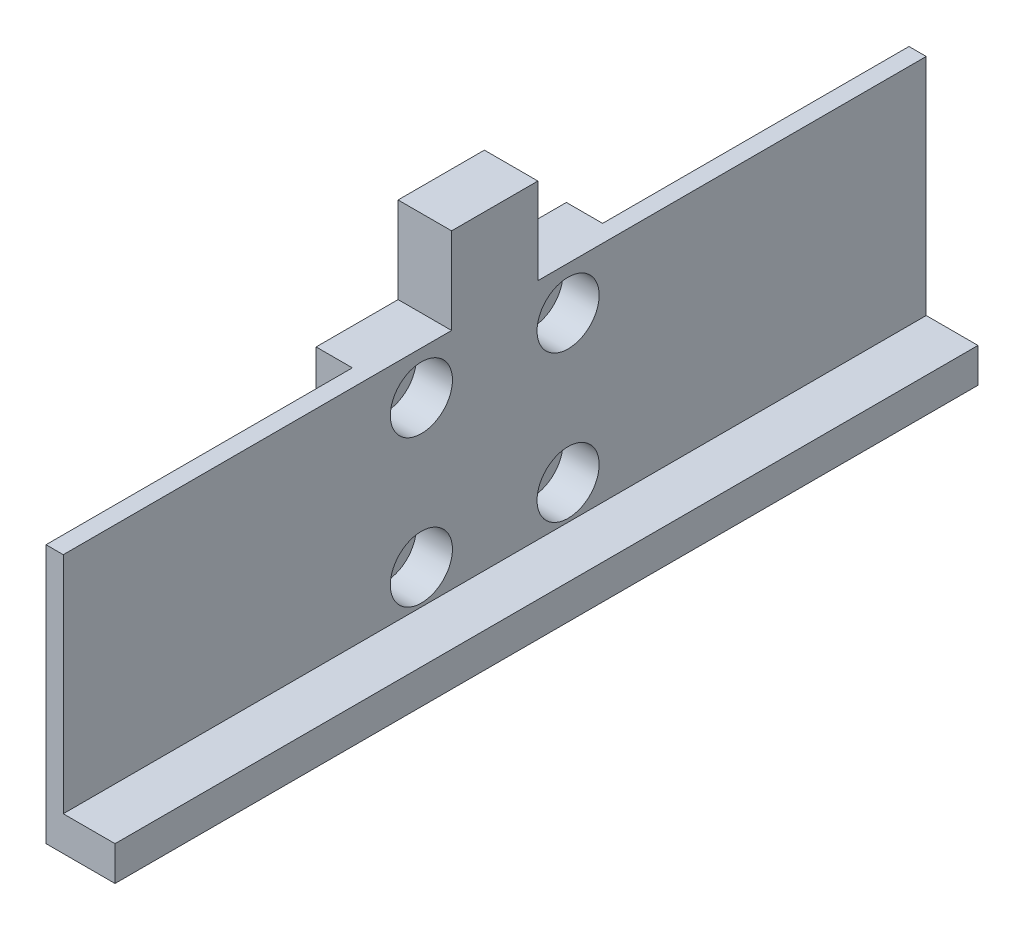
ISO-10303-21;
HEADER;
FILE_DESCRIPTION(('STEP AP214'),'2;1');
FILE_NAME('part.step','',(''),(''),'','','');
FILE_SCHEMA(('AUTOMOTIVE_DESIGN { 1 0 10303 214 1 1 1 1 }'));
ENDSEC;
DATA;
#1=APPLICATION_CONTEXT('core data for automotive mechanical design processes');
#2=APPLICATION_PROTOCOL_DEFINITION('international standard','automotive_design',2000,#1);
#3=PRODUCT_CONTEXT('',#1,'mechanical');
#4=PRODUCT('Part','Part','',(#3));
#5=PRODUCT_RELATED_PRODUCT_CATEGORY('part','',(#4));
#6=PRODUCT_DEFINITION_FORMATION('','',#4);
#7=PRODUCT_DEFINITION_CONTEXT('part definition',#1,'design');
#8=PRODUCT_DEFINITION('design','',#6,#7);
#9=PRODUCT_DEFINITION_SHAPE('','',#8);
#10=(LENGTH_UNIT() NAMED_UNIT(*) SI_UNIT(.MILLI.,.METRE.));
#11=(NAMED_UNIT(*) PLANE_ANGLE_UNIT() SI_UNIT($,.RADIAN.));
#12=(NAMED_UNIT(*) SI_UNIT($,.STERADIAN.) SOLID_ANGLE_UNIT());
#13=UNCERTAINTY_MEASURE_WITH_UNIT(LENGTH_MEASURE(1.E-05),#10,'distance_accuracy_value','');
#14=(GEOMETRIC_REPRESENTATION_CONTEXT(3) GLOBAL_UNCERTAINTY_ASSIGNED_CONTEXT((#13)) GLOBAL_UNIT_ASSIGNED_CONTEXT((#10,
#11,#12)) REPRESENTATION_CONTEXT('',''));
#15=CARTESIAN_POINT('',(0.,0.,0.));
#16=DIRECTION('',(0.,0.,1.));
#17=DIRECTION('',(1.,0.,0.));
#18=AXIS2_PLACEMENT_3D('',#15,#16,#17);
#19=CARTESIAN_POINT('',(6.,26.,-100.));
#20=DIRECTION('',(0.,1.,0.));
#21=DIRECTION('',(0.,0.,1.));
#22=AXIS2_PLACEMENT_3D('',#19,#20,#21);
#23=PLANE('',#22);
#24=DIRECTION('',(0.,0.,-1.));
#25=VECTOR('',#24,1.);
#26=CARTESIAN_POINT('',(14.2,26.,0.));
#27=LINE('',#26,#25);
#28=CARTESIAN_POINT('',(14.2,26.,0.));
#29=VERTEX_POINT('',#28);
#30=CARTESIAN_POINT('',(14.2,26.,-35.5));
#31=VERTEX_POINT('',#30);
#32=EDGE_CURVE('E142',#29,#31,#27,.T.);
#33=ORIENTED_EDGE('',*,*,#32,.F.);
#34=DIRECTION('',(1.,0.,0.));
#35=VECTOR('',#34,1.);
#36=CARTESIAN_POINT('',(6.,26.,0.));
#37=LINE('',#36,#35);
#38=CARTESIAN_POINT('',(16.2,26.,0.));
#39=VERTEX_POINT('',#38);
#40=EDGE_CURVE('E275',#29,#39,#37,.T.);
#41=ORIENTED_EDGE('',*,*,#40,.T.);
#42=DIRECTION('',(0.,0.,1.));
#43=VECTOR('',#42,1.);
#44=CARTESIAN_POINT('',(16.2,26.,-100.));
#45=LINE('',#44,#43);
#46=CARTESIAN_POINT('',(16.2,26.,-45.));
#47=VERTEX_POINT('',#46);
#48=EDGE_CURVE('E264',#47,#39,#45,.T.);
#49=ORIENTED_EDGE('',*,*,#48,.F.);
#50=DIRECTION('',(-1.,0.,0.));
#51=VECTOR('',#50,1.);
#52=CARTESIAN_POINT('',(30.3421356237309,26.,-45.));
#53=LINE('',#52,#51);
#54=CARTESIAN_POINT('',(10.,26.,-45.));
#55=VERTEX_POINT('',#54);
#56=EDGE_CURVE('E183',#47,#55,#53,.T.);
#57=ORIENTED_EDGE('',*,*,#56,.T.);
#58=DIRECTION('',(0.,0.,1.));
#59=VECTOR('',#58,1.);
#60=CARTESIAN_POINT('',(10.,26.,0.));
#61=LINE('',#60,#59);
#62=CARTESIAN_POINT('',(10.,26.,-35.5));
#63=VERTEX_POINT('',#62);
#64=EDGE_CURVE('E278',#55,#63,#61,.T.);
#65=ORIENTED_EDGE('',*,*,#64,.T.);
#66=DIRECTION('',(-1.,0.,0.));
#67=VECTOR('',#66,1.);
#68=CARTESIAN_POINT('',(14.2,26.,-35.5));
#69=LINE('',#68,#67);
#70=EDGE_CURVE('E155',#31,#63,#69,.T.);
#71=ORIENTED_EDGE('',*,*,#70,.F.);
#72=EDGE_LOOP('',(#33,#41,#49,#57,#65,#71));
#73=FACE_BOUND('',#72,.T.);
#74=ADVANCED_FACE('F35',(#73),#23,.T.);
#75=CARTESIAN_POINT('',(12.,0.,0.));
#76=DIRECTION('',(1.,0.,0.));
#77=DIRECTION('',(0.,0.,1.));
#78=AXIS2_PLACEMENT_3D('',#75,#76,#77);
#79=PLANE('',#78);
#80=CARTESIAN_POINT('',(12.,21.,-41.5));
#81=DIRECTION('',(-1.,0.,0.));
#82=DIRECTION('',(0.,0.,1.));
#83=AXIS2_PLACEMENT_3D('',#80,#81,#82);
#84=CIRCLE('',#83,2.1);
#85=CARTESIAN_POINT('',(12.,21.,-39.4));
#86=VERTEX_POINT('',#85);
#87=EDGE_CURVE('E282',#86,#86,#84,.T.);
#88=ORIENTED_EDGE('',*,*,#87,.T.);
#89=EDGE_LOOP('',(#88));
#90=FACE_BOUND('',#89,.T.);
#91=CARTESIAN_POINT('',(12.,21.,-41.5));
#92=DIRECTION('',(1.,0.,0.));
#93=DIRECTION('',(0.,0.,-1.));
#94=AXIS2_PLACEMENT_3D('',#91,#92,#93);
#95=CIRCLE('',#94,3.6);
#96=CARTESIAN_POINT('',(12.,21.,-45.1));
#97=VERTEX_POINT('',#96);
#98=EDGE_CURVE('E258',#97,#97,#95,.T.);
#99=ORIENTED_EDGE('',*,*,#98,.T.);
#100=EDGE_LOOP('',(#99));
#101=FACE_BOUND('',#100,.T.);
#102=ADVANCED_FACE('F310',(#90,#101),#79,.T.);
#103=CARTESIAN_POINT('',(12.,21.,-58.5));
#104=DIRECTION('',(-1.,0.,0.));
#105=DIRECTION('',(0.,0.,1.));
#106=AXIS2_PLACEMENT_3D('',#103,#104,#105);
#107=CIRCLE('',#106,2.1);
#108=CARTESIAN_POINT('',(12.,21.,-56.4));
#109=VERTEX_POINT('',#108);
#110=EDGE_CURVE('E285',#109,#109,#107,.T.);
#111=ORIENTED_EDGE('',*,*,#110,.T.);
#112=EDGE_LOOP('',(#111));
#113=FACE_BOUND('',#112,.T.);
#114=CARTESIAN_POINT('',(12.,21.,-58.5));
#115=DIRECTION('',(1.,0.,0.));
#116=DIRECTION('',(0.,0.,-1.));
#117=AXIS2_PLACEMENT_3D('',#114,#115,#116);
#118=CIRCLE('',#117,3.6);
#119=CARTESIAN_POINT('',(12.,21.,-62.1));
#120=VERTEX_POINT('',#119);
#121=EDGE_CURVE('E252',#120,#120,#118,.T.);
#122=ORIENTED_EDGE('',*,*,#121,.T.);
#123=EDGE_LOOP('',(#122));
#124=FACE_BOUND('',#123,.T.);
#125=ADVANCED_FACE('F319',(#113,#124),#79,.T.);
#126=CARTESIAN_POINT('',(12.,4.,-58.5));
#127=DIRECTION('',(-1.,0.,0.));
#128=DIRECTION('',(0.,0.,1.));
#129=AXIS2_PLACEMENT_3D('',#126,#127,#128);
#130=CIRCLE('',#129,2.1);
#131=CARTESIAN_POINT('',(12.,4.,-56.4));
#132=VERTEX_POINT('',#131);
#133=EDGE_CURVE('E43',#132,#132,#130,.T.);
#134=ORIENTED_EDGE('',*,*,#133,.T.);
#135=EDGE_LOOP('',(#134));
#136=FACE_BOUND('',#135,.T.);
#137=CARTESIAN_POINT('',(12.,4.,-58.5));
#138=DIRECTION('',(1.,0.,0.));
#139=DIRECTION('',(0.,0.,-1.));
#140=AXIS2_PLACEMENT_3D('',#137,#138,#139);
#141=CIRCLE('',#140,3.6);
#142=CARTESIAN_POINT('',(12.,4.,-62.1));
#143=VERTEX_POINT('',#142);
#144=EDGE_CURVE('E246',#143,#143,#141,.T.);
#145=ORIENTED_EDGE('',*,*,#144,.T.);
#146=EDGE_LOOP('',(#145));
#147=FACE_BOUND('',#146,.T.);
#148=ADVANCED_FACE('F290',(#136,#147),#79,.T.);
#149=CARTESIAN_POINT('',(12.,4.,-41.5));
#150=DIRECTION('',(-1.,0.,0.));
#151=DIRECTION('',(0.,0.,1.));
#152=AXIS2_PLACEMENT_3D('',#149,#150,#151);
#153=CIRCLE('',#152,2.1);
#154=CARTESIAN_POINT('',(12.,4.,-39.4));
#155=VERTEX_POINT('',#154);
#156=EDGE_CURVE('E11',#155,#155,#153,.T.);
#157=ORIENTED_EDGE('',*,*,#156,.T.);
#158=EDGE_LOOP('',(#157));
#159=FACE_BOUND('',#158,.T.);
#160=CARTESIAN_POINT('',(12.,4.,-41.5));
#161=DIRECTION('',(1.,0.,0.));
#162=DIRECTION('',(0.,0.,-1.));
#163=AXIS2_PLACEMENT_3D('',#160,#161,#162);
#164=CIRCLE('',#163,3.6);
#165=CARTESIAN_POINT('',(12.,4.,-45.1));
#166=VERTEX_POINT('',#165);
#167=EDGE_CURVE('E241',#166,#166,#164,.T.);
#168=ORIENTED_EDGE('',*,*,#167,.T.);
#169=EDGE_LOOP('',(#168));
#170=FACE_BOUND('',#169,.T.);
#171=ADVANCED_FACE('F322',(#159,#170),#79,.T.);
#172=CARTESIAN_POINT('',(24.,21.,-41.5));
#173=DIRECTION('',(-1.,0.,0.));
#174=DIRECTION('',(0.,0.,-1.));
#175=AXIS2_PLACEMENT_3D('',#172,#173,#174);
#176=CYLINDRICAL_SURFACE('',#175,2.1);
#177=CARTESIAN_POINT('',(10.,21.,-41.5));
#178=DIRECTION('',(1.,0.,0.));
#179=DIRECTION('',(0.,0.,-1.));
#180=AXIS2_PLACEMENT_3D('',#177,#178,#179);
#181=CIRCLE('',#180,2.1);
#182=CARTESIAN_POINT('',(10.,21.,-43.6));
#183=VERTEX_POINT('',#182);
#184=EDGE_CURVE('E215',#183,#183,#181,.F.);
#185=ORIENTED_EDGE('',*,*,#184,.T.);
#186=EDGE_LOOP('',(#185));
#187=FACE_BOUND('',#186,.T.);
#188=ORIENTED_EDGE('',*,*,#87,.F.);
#189=EDGE_LOOP('',(#188));
#190=FACE_BOUND('',#189,.T.);
#191=ADVANCED_FACE('F306',(#187,#190),#176,.F.);
#192=CARTESIAN_POINT('',(24.,21.,-58.5));
#193=DIRECTION('',(-1.,0.,0.));
#194=DIRECTION('',(0.,0.,-1.));
#195=AXIS2_PLACEMENT_3D('',#192,#193,#194);
#196=CYLINDRICAL_SURFACE('',#195,2.1);
#197=CARTESIAN_POINT('',(10.,21.,-58.5));
#198=DIRECTION('',(1.,0.,0.));
#199=DIRECTION('',(0.,0.,-1.));
#200=AXIS2_PLACEMENT_3D('',#197,#198,#199);
#201=CIRCLE('',#200,2.1);
#202=CARTESIAN_POINT('',(10.,21.,-60.6));
#203=VERTEX_POINT('',#202);
#204=EDGE_CURVE('E212',#203,#203,#201,.F.);
#205=ORIENTED_EDGE('',*,*,#204,.T.);
#206=EDGE_LOOP('',(#205));
#207=FACE_BOUND('',#206,.T.);
#208=ORIENTED_EDGE('',*,*,#110,.F.);
#209=EDGE_LOOP('',(#208));
#210=FACE_BOUND('',#209,.T.);
#211=ADVANCED_FACE('F296',(#207,#210),#196,.F.);
#212=CARTESIAN_POINT('',(24.,4.,-58.5));
#213=DIRECTION('',(-1.,0.,0.));
#214=DIRECTION('',(0.,0.,-1.));
#215=AXIS2_PLACEMENT_3D('',#212,#213,#214);
#216=CYLINDRICAL_SURFACE('',#215,2.1);
#217=CARTESIAN_POINT('',(10.,4.,-58.5));
#218=DIRECTION('',(1.,0.,0.));
#219=DIRECTION('',(0.,0.,-1.));
#220=AXIS2_PLACEMENT_3D('',#217,#218,#219);
#221=CIRCLE('',#220,2.1);
#222=CARTESIAN_POINT('',(10.,4.,-60.6));
#223=VERTEX_POINT('',#222);
#224=EDGE_CURVE('E209',#223,#223,#221,.F.);
#225=ORIENTED_EDGE('',*,*,#224,.T.);
#226=EDGE_LOOP('',(#225));
#227=FACE_BOUND('',#226,.T.);
#228=ORIENTED_EDGE('',*,*,#133,.F.);
#229=EDGE_LOOP('',(#228));
#230=FACE_BOUND('',#229,.T.);
#231=ADVANCED_FACE('F293',(#227,#230),#216,.F.);
#232=CARTESIAN_POINT('',(24.,4.,-41.5));
#233=DIRECTION('',(-1.,0.,0.));
#234=DIRECTION('',(0.,0.,-1.));
#235=AXIS2_PLACEMENT_3D('',#232,#233,#234);
#236=CYLINDRICAL_SURFACE('',#235,2.1);
#237=CARTESIAN_POINT('',(10.,4.,-41.5));
#238=DIRECTION('',(1.,0.,0.));
#239=DIRECTION('',(0.,0.,-1.));
#240=AXIS2_PLACEMENT_3D('',#237,#238,#239);
#241=CIRCLE('',#240,2.1);
#242=CARTESIAN_POINT('',(10.,4.,-43.6));
#243=VERTEX_POINT('',#242);
#244=EDGE_CURVE('E206',#243,#243,#241,.F.);
#245=ORIENTED_EDGE('',*,*,#244,.T.);
#246=EDGE_LOOP('',(#245));
#247=FACE_BOUND('',#246,.T.);
#248=ORIENTED_EDGE('',*,*,#156,.F.);
#249=EDGE_LOOP('',(#248));
#250=FACE_BOUND('',#249,.T.);
#251=ADVANCED_FACE('F295',(#247,#250),#236,.F.);
#252=CARTESIAN_POINT('',(10.,0.,-100.));
#253=DIRECTION('',(0.,0.,1.));
#254=DIRECTION('',(-1.,0.,0.));
#255=AXIS2_PLACEMENT_3D('',#252,#253,#254);
#256=PLANE('',#255);
#257=DIRECTION('',(1.,0.,0.));
#258=VECTOR('',#257,1.);
#259=CARTESIAN_POINT('',(-94.0799680255744,-4.,-100.));
#260=LINE('',#259,#258);
#261=CARTESIAN_POINT('',(14.2,-4.,-100.));
#262=VERTEX_POINT('',#261);
#263=CARTESIAN_POINT('',(22.2,-4.,-100.));
#264=VERTEX_POINT('',#263);
#265=EDGE_CURVE('E239',#262,#264,#260,.T.);
#266=ORIENTED_EDGE('',*,*,#265,.F.);
#267=DIRECTION('',(0.,1.,0.));
#268=VECTOR('',#267,1.);
#269=CARTESIAN_POINT('',(14.2,-4.,-100.));
#270=LINE('',#269,#268);
#271=CARTESIAN_POINT('',(14.2,26.,-100.));
#272=VERTEX_POINT('',#271);
#273=EDGE_CURVE('E159',#262,#272,#270,.T.);
#274=ORIENTED_EDGE('',*,*,#273,.T.);
#275=DIRECTION('',(1.,0.,0.));
#276=VECTOR('',#275,1.);
#277=CARTESIAN_POINT('',(6.,26.,-100.));
#278=LINE('',#277,#276);
#279=CARTESIAN_POINT('',(16.2,26.,-100.));
#280=VERTEX_POINT('',#279);
#281=EDGE_CURVE('E276',#272,#280,#278,.T.);
#282=ORIENTED_EDGE('',*,*,#281,.T.);
#283=DIRECTION('',(0.,1.,0.));
#284=VECTOR('',#283,1.);
#285=CARTESIAN_POINT('',(16.2,0.,-100.));
#286=LINE('',#285,#284);
#287=CARTESIAN_POINT('',(16.2,0.,-100.));
#288=VERTEX_POINT('',#287);
#289=EDGE_CURVE('E272',#288,#280,#286,.T.);
#290=ORIENTED_EDGE('',*,*,#289,.F.);
#291=DIRECTION('',(-1.,0.,0.));
#292=VECTOR('',#291,1.);
#293=CARTESIAN_POINT('',(22.2,0.,-100.));
#294=LINE('',#293,#292);
#295=CARTESIAN_POINT('',(22.2,0.,-100.));
#296=VERTEX_POINT('',#295);
#297=EDGE_CURVE('E236',#296,#288,#294,.T.);
#298=ORIENTED_EDGE('',*,*,#297,.F.);
#299=DIRECTION('',(0.,1.,0.));
#300=VECTOR('',#299,1.);
#301=CARTESIAN_POINT('',(22.2,0.,-100.));
#302=LINE('',#301,#300);
#303=EDGE_CURVE('E227',#264,#296,#302,.T.);
#304=ORIENTED_EDGE('',*,*,#303,.F.);
#305=EDGE_LOOP('',(#266,#274,#282,#290,#298,#304));
#306=FACE_BOUND('',#305,.T.);
#307=ADVANCED_FACE('F303',(#306),#256,.F.);
#308=CARTESIAN_POINT('',(10.,0.,0.));
#309=DIRECTION('',(0.,0.,-1.));
#310=DIRECTION('',(1.,0.,0.));
#311=AXIS2_PLACEMENT_3D('',#308,#309,#310);
#312=PLANE('',#311);
#313=ORIENTED_EDGE('',*,*,#40,.F.);
#314=DIRECTION('',(0.,1.,0.));
#315=VECTOR('',#314,1.);
#316=CARTESIAN_POINT('',(14.2,-4.,0.));
#317=LINE('',#316,#315);
#318=CARTESIAN_POINT('',(14.2,-4.,0.));
#319=VERTEX_POINT('',#318);
#320=EDGE_CURVE('E161',#319,#29,#317,.T.);
#321=ORIENTED_EDGE('',*,*,#320,.F.);
#322=DIRECTION('',(1.,0.,0.));
#323=VECTOR('',#322,1.);
#324=CARTESIAN_POINT('',(-94.0799680255744,-4.,0.));
#325=LINE('',#324,#323);
#326=CARTESIAN_POINT('',(22.2,-4.,0.));
#327=VERTEX_POINT('',#326);
#328=EDGE_CURVE('E154',#319,#327,#325,.T.);
#329=ORIENTED_EDGE('',*,*,#328,.T.);
#330=DIRECTION('',(0.,-1.,0.));
#331=VECTOR('',#330,1.);
#332=CARTESIAN_POINT('',(22.2,0.,0.));
#333=LINE('',#332,#331);
#334=CARTESIAN_POINT('',(22.2,0.,0.));
#335=VERTEX_POINT('',#334);
#336=EDGE_CURVE('E221',#335,#327,#333,.T.);
#337=ORIENTED_EDGE('',*,*,#336,.F.);
#338=DIRECTION('',(-1.,0.,0.));
#339=VECTOR('',#338,1.);
#340=CARTESIAN_POINT('',(22.2,0.,0.));
#341=LINE('',#340,#339);
#342=CARTESIAN_POINT('',(16.2,0.,0.));
#343=VERTEX_POINT('',#342);
#344=EDGE_CURVE('E231',#335,#343,#341,.T.);
#345=ORIENTED_EDGE('',*,*,#344,.T.);
#346=DIRECTION('',(0.,-1.,0.));
#347=VECTOR('',#346,1.);
#348=CARTESIAN_POINT('',(16.2,26.,0.));
#349=LINE('',#348,#347);
#350=EDGE_CURVE('E270',#39,#343,#349,.T.);
#351=ORIENTED_EDGE('',*,*,#350,.F.);
#352=EDGE_LOOP('',(#313,#321,#329,#337,#345,#351));
#353=FACE_BOUND('',#352,.T.);
#354=ADVANCED_FACE('F37',(#353),#312,.F.);
#355=CARTESIAN_POINT('',(10.,0.,0.));
#356=DIRECTION('',(1.,0.,0.));
#357=DIRECTION('',(0.,0.,1.));
#358=AXIS2_PLACEMENT_3D('',#355,#356,#357);
#359=PLANE('',#358);
#360=DIRECTION('',(0.,0.,-1.));
#361=VECTOR('',#360,1.);
#362=CARTESIAN_POINT('',(10.,-4.,0.));
#363=LINE('',#362,#361);
#364=CARTESIAN_POINT('',(10.,-4.,-35.5));
#365=VERTEX_POINT('',#364);
#366=CARTESIAN_POINT('',(10.,-4.,-64.5));
#367=VERTEX_POINT('',#366);
#368=EDGE_CURVE('E218',#365,#367,#363,.T.);
#369=ORIENTED_EDGE('',*,*,#368,.F.);
#370=DIRECTION('',(0.,1.,0.));
#371=VECTOR('',#370,1.);
#372=CARTESIAN_POINT('',(10.,-4.,-35.5));
#373=LINE('',#372,#371);
#374=EDGE_CURVE('E58',#365,#63,#373,.T.);
#375=ORIENTED_EDGE('',*,*,#374,.T.);
#376=ORIENTED_EDGE('',*,*,#64,.F.);
#377=DIRECTION('',(0.,1.,0.));
#378=VECTOR('',#377,1.);
#379=CARTESIAN_POINT('',(10.,26.,-45.));
#380=LINE('',#379,#378);
#381=CARTESIAN_POINT('',(10.,36.,-45.));
#382=VERTEX_POINT('',#381);
#383=EDGE_CURVE('E184',#55,#382,#380,.T.);
#384=ORIENTED_EDGE('',*,*,#383,.T.);
#385=DIRECTION('',(0.,0.,-1.));
#386=VECTOR('',#385,1.);
#387=CARTESIAN_POINT('',(10.,36.,-55.));
#388=LINE('',#387,#386);
#389=CARTESIAN_POINT('',(10.,36.,-55.));
#390=VERTEX_POINT('',#389);
#391=EDGE_CURVE('E180',#382,#390,#388,.T.);
#392=ORIENTED_EDGE('',*,*,#391,.T.);
#393=DIRECTION('',(0.,-1.,0.));
#394=VECTOR('',#393,1.);
#395=CARTESIAN_POINT('',(10.,26.,-55.));
#396=LINE('',#395,#394);
#397=CARTESIAN_POINT('',(10.,26.,-55.));
#398=VERTEX_POINT('',#397);
#399=EDGE_CURVE('E163',#390,#398,#396,.T.);
#400=ORIENTED_EDGE('',*,*,#399,.T.);
#401=CARTESIAN_POINT('',(10.,26.,-64.5));
#402=VERTEX_POINT('',#401);
#403=EDGE_CURVE('E280',#402,#398,#61,.T.);
#404=ORIENTED_EDGE('',*,*,#403,.F.);
#405=DIRECTION('',(0.,1.,0.));
#406=VECTOR('',#405,1.);
#407=CARTESIAN_POINT('',(10.,-4.,-64.5));
#408=LINE('',#407,#406);
#409=EDGE_CURVE('E170',#367,#402,#408,.T.);
#410=ORIENTED_EDGE('',*,*,#409,.F.);
#411=EDGE_LOOP('',(#369,#375,#376,#384,#392,#400,#404,#410));
#412=FACE_BOUND('',#411,.T.);
#413=ORIENTED_EDGE('',*,*,#204,.F.);
#414=EDGE_LOOP('',(#413));
#415=FACE_BOUND('',#414,.T.);
#416=ORIENTED_EDGE('',*,*,#244,.F.);
#417=EDGE_LOOP('',(#416));
#418=FACE_BOUND('',#417,.T.);
#419=ORIENTED_EDGE('',*,*,#224,.F.);
#420=EDGE_LOOP('',(#419));
#421=FACE_BOUND('',#420,.T.);
#422=ORIENTED_EDGE('',*,*,#184,.F.);
#423=EDGE_LOOP('',(#422));
#424=FACE_BOUND('',#423,.T.);
#425=ADVANCED_FACE('F326',(#412,#415,#418,#421,#424),#359,.F.);
#426=DIRECTION('',(0.,0.,-1.));
#427=VECTOR('',#426,1.);
#428=CARTESIAN_POINT('',(14.2,26.,-100.));
#429=LINE('',#428,#427);
#430=CARTESIAN_POINT('',(14.2,26.,-64.5));
#431=VERTEX_POINT('',#430);
#432=EDGE_CURVE('E168',#431,#272,#429,.T.);
#433=ORIENTED_EDGE('',*,*,#432,.F.);
#434=DIRECTION('',(1.,0.,0.));
#435=VECTOR('',#434,1.);
#436=CARTESIAN_POINT('',(10.,26.,-64.5));
#437=LINE('',#436,#435);
#438=EDGE_CURVE('E171',#402,#431,#437,.T.);
#439=ORIENTED_EDGE('',*,*,#438,.F.);
#440=ORIENTED_EDGE('',*,*,#403,.T.);
#441=DIRECTION('',(-1.,0.,0.));
#442=VECTOR('',#441,1.);
#443=CARTESIAN_POINT('',(30.3421356237309,26.,-55.));
#444=LINE('',#443,#442);
#445=CARTESIAN_POINT('',(16.2,26.,-55.));
#446=VERTEX_POINT('',#445);
#447=EDGE_CURVE('E191',#446,#398,#444,.T.);
#448=ORIENTED_EDGE('',*,*,#447,.F.);
#449=EDGE_CURVE('E267',#280,#446,#45,.T.);
#450=ORIENTED_EDGE('',*,*,#449,.F.);
#451=ORIENTED_EDGE('',*,*,#281,.F.);
#452=EDGE_LOOP('',(#433,#439,#440,#448,#450,#451));
#453=FACE_BOUND('',#452,.T.);
#454=ADVANCED_FACE('F313',(#453),#23,.T.);
#455=CARTESIAN_POINT('',(16.2,0.,0.));
#456=DIRECTION('',(1.,0.,0.));
#457=DIRECTION('',(0.,0.,-1.));
#458=AXIS2_PLACEMENT_3D('',#455,#456,#457);
#459=PLANE('',#458);
#460=DIRECTION('',(0.,0.,1.));
#461=VECTOR('',#460,1.);
#462=CARTESIAN_POINT('',(16.2,0.,0.));
#463=LINE('',#462,#461);
#464=EDGE_CURVE('E220',#288,#343,#463,.T.);
#465=ORIENTED_EDGE('',*,*,#464,.F.);
#466=ORIENTED_EDGE('',*,*,#289,.T.);
#467=ORIENTED_EDGE('',*,*,#449,.T.);
#468=DIRECTION('',(0.,-1.,0.));
#469=VECTOR('',#468,1.);
#470=CARTESIAN_POINT('',(16.2,26.,-55.));
#471=LINE('',#470,#469);
#472=CARTESIAN_POINT('',(16.2,36.,-55.));
#473=VERTEX_POINT('',#472);
#474=EDGE_CURVE('E189',#473,#446,#471,.T.);
#475=ORIENTED_EDGE('',*,*,#474,.F.);
#476=DIRECTION('',(0.,0.,-1.));
#477=VECTOR('',#476,1.);
#478=CARTESIAN_POINT('',(16.2,36.,-55.));
#479=LINE('',#478,#477);
#480=CARTESIAN_POINT('',(16.2,36.,-45.));
#481=VERTEX_POINT('',#480);
#482=EDGE_CURVE('E193',#481,#473,#479,.T.);
#483=ORIENTED_EDGE('',*,*,#482,.F.);
#484=DIRECTION('',(0.,1.,0.));
#485=VECTOR('',#484,1.);
#486=CARTESIAN_POINT('',(16.2,26.,-45.));
#487=LINE('',#486,#485);
#488=EDGE_CURVE('E197',#47,#481,#487,.T.);
#489=ORIENTED_EDGE('',*,*,#488,.F.);
#490=ORIENTED_EDGE('',*,*,#48,.T.);
#491=ORIENTED_EDGE('',*,*,#350,.T.);
#492=EDGE_LOOP('',(#465,#466,#467,#475,#483,#489,#490,#491));
#493=FACE_BOUND('',#492,.T.);
#494=CARTESIAN_POINT('',(16.2,4.,-58.5));
#495=DIRECTION('',(1.,0.,0.));
#496=DIRECTION('',(0.,0.,-1.));
#497=AXIS2_PLACEMENT_3D('',#494,#495,#496);
#498=CIRCLE('',#497,3.6);
#499=CARTESIAN_POINT('',(16.2,4.,-62.1));
#500=VERTEX_POINT('',#499);
#501=EDGE_CURVE('E249',#500,#500,#498,.T.);
#502=ORIENTED_EDGE('',*,*,#501,.F.);
#503=EDGE_LOOP('',(#502));
#504=FACE_BOUND('',#503,.T.);
#505=CARTESIAN_POINT('',(16.2,21.,-41.5));
#506=DIRECTION('',(1.,0.,0.));
#507=DIRECTION('',(0.,0.,-1.));
#508=AXIS2_PLACEMENT_3D('',#505,#506,#507);
#509=CIRCLE('',#508,3.6);
#510=CARTESIAN_POINT('',(16.2,21.,-45.1));
#511=VERTEX_POINT('',#510);
#512=EDGE_CURVE('E261',#511,#511,#509,.T.);
#513=ORIENTED_EDGE('',*,*,#512,.F.);
#514=EDGE_LOOP('',(#513));
#515=FACE_BOUND('',#514,.T.);
#516=CARTESIAN_POINT('',(16.2,21.,-58.5));
#517=DIRECTION('',(1.,0.,0.));
#518=DIRECTION('',(0.,0.,-1.));
#519=AXIS2_PLACEMENT_3D('',#516,#517,#518);
#520=CIRCLE('',#519,3.6);
#521=CARTESIAN_POINT('',(16.2,21.,-62.1));
#522=VERTEX_POINT('',#521);
#523=EDGE_CURVE('E255',#522,#522,#520,.T.);
#524=ORIENTED_EDGE('',*,*,#523,.F.);
#525=EDGE_LOOP('',(#524));
#526=FACE_BOUND('',#525,.T.);
#527=CARTESIAN_POINT('',(16.2,4.,-41.5));
#528=DIRECTION('',(1.,0.,0.));
#529=DIRECTION('',(0.,0.,-1.));
#530=AXIS2_PLACEMENT_3D('',#527,#528,#529);
#531=CIRCLE('',#530,3.6);
#532=CARTESIAN_POINT('',(16.2,4.,-45.1));
#533=VERTEX_POINT('',#532);
#534=EDGE_CURVE('E243',#533,#533,#531,.T.);
#535=ORIENTED_EDGE('',*,*,#534,.F.);
#536=EDGE_LOOP('',(#535));
#537=FACE_BOUND('',#536,.T.);
#538=ADVANCED_FACE('F325',(#493,#504,#515,#526,#537),#459,.T.);
#539=CARTESIAN_POINT('',(16.2,21.,-41.5));
#540=DIRECTION('',(-1.,0.,0.));
#541=DIRECTION('',(0.,0.,1.));
#542=AXIS2_PLACEMENT_3D('',#539,#540,#541);
#543=CYLINDRICAL_SURFACE('',#542,3.6);
#544=ORIENTED_EDGE('',*,*,#512,.T.);
#545=EDGE_LOOP('',(#544));
#546=FACE_BOUND('',#545,.T.);
#547=ORIENTED_EDGE('',*,*,#98,.F.);
#548=EDGE_LOOP('',(#547));
#549=FACE_BOUND('',#548,.T.);
#550=ADVANCED_FACE('F333',(#546,#549),#543,.F.);
#551=CARTESIAN_POINT('',(16.2,21.,-58.5));
#552=DIRECTION('',(-1.,0.,0.));
#553=DIRECTION('',(0.,0.,1.));
#554=AXIS2_PLACEMENT_3D('',#551,#552,#553);
#555=CYLINDRICAL_SURFACE('',#554,3.6);
#556=ORIENTED_EDGE('',*,*,#523,.T.);
#557=EDGE_LOOP('',(#556));
#558=FACE_BOUND('',#557,.T.);
#559=ORIENTED_EDGE('',*,*,#121,.F.);
#560=EDGE_LOOP('',(#559));
#561=FACE_BOUND('',#560,.T.);
#562=ADVANCED_FACE('F399',(#558,#561),#555,.F.);
#563=CARTESIAN_POINT('',(16.2,4.,-58.5));
#564=DIRECTION('',(-1.,0.,0.));
#565=DIRECTION('',(0.,0.,1.));
#566=AXIS2_PLACEMENT_3D('',#563,#564,#565);
#567=CYLINDRICAL_SURFACE('',#566,3.6);
#568=ORIENTED_EDGE('',*,*,#501,.T.);
#569=EDGE_LOOP('',(#568));
#570=FACE_BOUND('',#569,.T.);
#571=ORIENTED_EDGE('',*,*,#144,.F.);
#572=EDGE_LOOP('',(#571));
#573=FACE_BOUND('',#572,.T.);
#574=ADVANCED_FACE('F395',(#570,#573),#567,.F.);
#575=CARTESIAN_POINT('',(16.2,4.,-41.5));
#576=DIRECTION('',(-1.,0.,0.));
#577=DIRECTION('',(0.,0.,1.));
#578=AXIS2_PLACEMENT_3D('',#575,#576,#577);
#579=CYLINDRICAL_SURFACE('',#578,3.6);
#580=ORIENTED_EDGE('',*,*,#534,.T.);
#581=EDGE_LOOP('',(#580));
#582=FACE_BOUND('',#581,.T.);
#583=ORIENTED_EDGE('',*,*,#167,.F.);
#584=EDGE_LOOP('',(#583));
#585=FACE_BOUND('',#584,.T.);
#586=ADVANCED_FACE('F392',(#582,#585),#579,.F.);
#587=CARTESIAN_POINT('',(-94.0799680255744,-4.,-100.));
#588=DIRECTION('',(0.,1.,0.));
#589=DIRECTION('',(0.,0.,1.));
#590=AXIS2_PLACEMENT_3D('',#587,#588,#589);
#591=PLANE('',#590);
#592=ORIENTED_EDGE('',*,*,#328,.F.);
#593=DIRECTION('',(0.,0.,-1.));
#594=VECTOR('',#593,1.);
#595=CARTESIAN_POINT('',(14.2,-4.,0.));
#596=LINE('',#595,#594);
#597=CARTESIAN_POINT('',(14.2,-4.,-35.5));
#598=VERTEX_POINT('',#597);
#599=EDGE_CURVE('E139',#319,#598,#596,.T.);
#600=ORIENTED_EDGE('',*,*,#599,.T.);
#601=DIRECTION('',(-1.,0.,0.));
#602=VECTOR('',#601,1.);
#603=CARTESIAN_POINT('',(14.2,-4.,-35.5));
#604=LINE('',#603,#602);
#605=EDGE_CURVE('E144',#598,#365,#604,.T.);
#606=ORIENTED_EDGE('',*,*,#605,.T.);
#607=ORIENTED_EDGE('',*,*,#368,.T.);
#608=DIRECTION('',(1.,0.,0.));
#609=VECTOR('',#608,1.);
#610=CARTESIAN_POINT('',(10.,-4.,-64.5));
#611=LINE('',#610,#609);
#612=CARTESIAN_POINT('',(14.2,-4.,-64.5));
#613=VERTEX_POINT('',#612);
#614=EDGE_CURVE('E165',#367,#613,#611,.T.);
#615=ORIENTED_EDGE('',*,*,#614,.T.);
#616=DIRECTION('',(0.,0.,-1.));
#617=VECTOR('',#616,1.);
#618=CARTESIAN_POINT('',(14.2,-4.,-100.));
#619=LINE('',#618,#617);
#620=EDGE_CURVE('E50',#613,#262,#619,.T.);
#621=ORIENTED_EDGE('',*,*,#620,.T.);
#622=ORIENTED_EDGE('',*,*,#265,.T.);
#623=DIRECTION('',(0.,0.,-1.));
#624=VECTOR('',#623,1.);
#625=CARTESIAN_POINT('',(22.2,-4.,0.));
#626=LINE('',#625,#624);
#627=EDGE_CURVE('E224',#327,#264,#626,.T.);
#628=ORIENTED_EDGE('',*,*,#627,.F.);
#629=EDGE_LOOP('',(#592,#600,#606,#607,#615,#621,#622,#628));
#630=FACE_BOUND('',#629,.T.);
#631=ADVANCED_FACE('F152',(#630),#591,.F.);
#632=CARTESIAN_POINT('',(22.2,0.,0.));
#633=DIRECTION('',(0.,-1.,0.));
#634=DIRECTION('',(0.,0.,-1.));
#635=AXIS2_PLACEMENT_3D('',#632,#633,#634);
#636=PLANE('',#635);
#637=ORIENTED_EDGE('',*,*,#464,.T.);
#638=ORIENTED_EDGE('',*,*,#344,.F.);
#639=DIRECTION('',(0.,0.,1.));
#640=VECTOR('',#639,1.);
#641=CARTESIAN_POINT('',(22.2,0.,0.));
#642=LINE('',#641,#640);
#643=EDGE_CURVE('E229',#296,#335,#642,.T.);
#644=ORIENTED_EDGE('',*,*,#643,.F.);
#645=ORIENTED_EDGE('',*,*,#297,.T.);
#646=EDGE_LOOP('',(#637,#638,#644,#645));
#647=FACE_BOUND('',#646,.T.);
#648=ADVANCED_FACE('F387',(#647),#636,.F.);
#649=CARTESIAN_POINT('',(22.2,0.,0.));
#650=DIRECTION('',(1.,0.,0.));
#651=DIRECTION('',(0.,0.,-1.));
#652=AXIS2_PLACEMENT_3D('',#649,#650,#651);
#653=PLANE('',#652);
#654=ORIENTED_EDGE('',*,*,#336,.T.);
#655=ORIENTED_EDGE('',*,*,#627,.T.);
#656=ORIENTED_EDGE('',*,*,#303,.T.);
#657=ORIENTED_EDGE('',*,*,#643,.T.);
#658=EDGE_LOOP('',(#654,#655,#656,#657));
#659=FACE_BOUND('',#658,.T.);
#660=ADVANCED_FACE('F349',(#659),#653,.T.);
#661=CARTESIAN_POINT('',(30.3421356237309,26.,-45.));
#662=DIRECTION('',(0.,0.,1.));
#663=DIRECTION('',(0.,-1.,0.));
#664=AXIS2_PLACEMENT_3D('',#661,#662,#663);
#665=PLANE('',#664);
#666=ORIENTED_EDGE('',*,*,#56,.F.);
#667=ORIENTED_EDGE('',*,*,#488,.T.);
#668=DIRECTION('',(-1.,0.,0.));
#669=VECTOR('',#668,1.);
#670=CARTESIAN_POINT('',(30.3421356237309,36.,-45.));
#671=LINE('',#670,#669);
#672=EDGE_CURVE('E196',#481,#382,#671,.T.);
#673=ORIENTED_EDGE('',*,*,#672,.T.);
#674=ORIENTED_EDGE('',*,*,#383,.F.);
#675=EDGE_LOOP('',(#666,#667,#673,#674));
#676=FACE_BOUND('',#675,.T.);
#677=ADVANCED_FACE('F380',(#676),#665,.T.);
#678=CARTESIAN_POINT('',(30.3421356237309,36.,-55.));
#679=DIRECTION('',(0.,1.,0.));
#680=DIRECTION('',(0.,0.,1.));
#681=AXIS2_PLACEMENT_3D('',#678,#679,#680);
#682=PLANE('',#681);
#683=ORIENTED_EDGE('',*,*,#672,.F.);
#684=ORIENTED_EDGE('',*,*,#482,.T.);
#685=DIRECTION('',(-1.,0.,0.));
#686=VECTOR('',#685,1.);
#687=CARTESIAN_POINT('',(30.3421356237309,36.,-55.));
#688=LINE('',#687,#686);
#689=EDGE_CURVE('E192',#473,#390,#688,.T.);
#690=ORIENTED_EDGE('',*,*,#689,.T.);
#691=ORIENTED_EDGE('',*,*,#391,.F.);
#692=EDGE_LOOP('',(#683,#684,#690,#691));
#693=FACE_BOUND('',#692,.T.);
#694=ADVANCED_FACE('F376',(#693),#682,.T.);
#695=CARTESIAN_POINT('',(30.3421356237309,26.,-55.));
#696=DIRECTION('',(0.,0.,-1.));
#697=DIRECTION('',(-1.,0.,0.));
#698=AXIS2_PLACEMENT_3D('',#695,#696,#697);
#699=PLANE('',#698);
#700=ORIENTED_EDGE('',*,*,#689,.F.);
#701=ORIENTED_EDGE('',*,*,#474,.T.);
#702=ORIENTED_EDGE('',*,*,#447,.T.);
#703=ORIENTED_EDGE('',*,*,#399,.F.);
#704=EDGE_LOOP('',(#700,#701,#702,#703));
#705=FACE_BOUND('',#704,.T.);
#706=ADVANCED_FACE('F371',(#705),#699,.T.);
#707=CARTESIAN_POINT('',(14.2,-4.,-100.));
#708=DIRECTION('',(1.,0.,0.));
#709=DIRECTION('',(0.,0.,-1.));
#710=AXIS2_PLACEMENT_3D('',#707,#708,#709);
#711=PLANE('',#710);
#712=ORIENTED_EDGE('',*,*,#432,.T.);
#713=ORIENTED_EDGE('',*,*,#273,.F.);
#714=ORIENTED_EDGE('',*,*,#620,.F.);
#715=DIRECTION('',(0.,1.,0.));
#716=VECTOR('',#715,1.);
#717=CARTESIAN_POINT('',(14.2,-4.,-64.5));
#718=LINE('',#717,#716);
#719=EDGE_CURVE('E177',#613,#431,#718,.T.);
#720=ORIENTED_EDGE('',*,*,#719,.T.);
#721=EDGE_LOOP('',(#712,#713,#714,#720));
#722=FACE_BOUND('',#721,.T.);
#723=ADVANCED_FACE('F342',(#722),#711,.F.);
#724=CARTESIAN_POINT('',(10.,-4.,-64.5));
#725=DIRECTION('',(0.,0.,1.));
#726=DIRECTION('',(1.,0.,0.));
#727=AXIS2_PLACEMENT_3D('',#724,#725,#726);
#728=PLANE('',#727);
#729=ORIENTED_EDGE('',*,*,#438,.T.);
#730=ORIENTED_EDGE('',*,*,#719,.F.);
#731=ORIENTED_EDGE('',*,*,#614,.F.);
#732=ORIENTED_EDGE('',*,*,#409,.T.);
#733=EDGE_LOOP('',(#729,#730,#731,#732));
#734=FACE_BOUND('',#733,.T.);
#735=ADVANCED_FACE('F363',(#734),#728,.F.);
#736=CARTESIAN_POINT('',(14.2,-4.,0.));
#737=DIRECTION('',(1.,0.,0.));
#738=DIRECTION('',(0.,0.,-1.));
#739=AXIS2_PLACEMENT_3D('',#736,#737,#738);
#740=PLANE('',#739);
#741=ORIENTED_EDGE('',*,*,#32,.T.);
#742=DIRECTION('',(0.,1.,0.));
#743=VECTOR('',#742,1.);
#744=CARTESIAN_POINT('',(14.2,-4.,-35.5));
#745=LINE('',#744,#743);
#746=EDGE_CURVE('E136',#598,#31,#745,.T.);
#747=ORIENTED_EDGE('',*,*,#746,.F.);
#748=ORIENTED_EDGE('',*,*,#599,.F.);
#749=ORIENTED_EDGE('',*,*,#320,.T.);
#750=EDGE_LOOP('',(#741,#747,#748,#749));
#751=FACE_BOUND('',#750,.T.);
#752=ADVANCED_FACE('F137',(#751),#740,.F.);
#753=CARTESIAN_POINT('',(14.2,-4.,-35.5));
#754=DIRECTION('',(0.,0.,-1.));
#755=DIRECTION('',(-1.,0.,0.));
#756=AXIS2_PLACEMENT_3D('',#753,#754,#755);
#757=PLANE('',#756);
#758=ORIENTED_EDGE('',*,*,#70,.T.);
#759=ORIENTED_EDGE('',*,*,#374,.F.);
#760=ORIENTED_EDGE('',*,*,#605,.F.);
#761=ORIENTED_EDGE('',*,*,#746,.T.);
#762=EDGE_LOOP('',(#758,#759,#760,#761));
#763=FACE_BOUND('',#762,.T.);
#764=ADVANCED_FACE('F146',(#763),#757,.F.);
#765=CLOSED_SHELL('',(#74,#102,#125,#148,#171,#191,#211,#231,#251,#307,#354,#425,#454,#538,#550,
#562,#574,#586,#631,#648,#660,#677,#694,#706,#723,#735,#752,#764));
#766=MANIFOLD_SOLID_BREP('B2',#765);
#767=ADVANCED_BREP_SHAPE_REPRESENTATION('',(#18,#766),#14);
#768=SHAPE_DEFINITION_REPRESENTATION(#9,#767);
ENDSEC;
END-ISO-10303-21;
